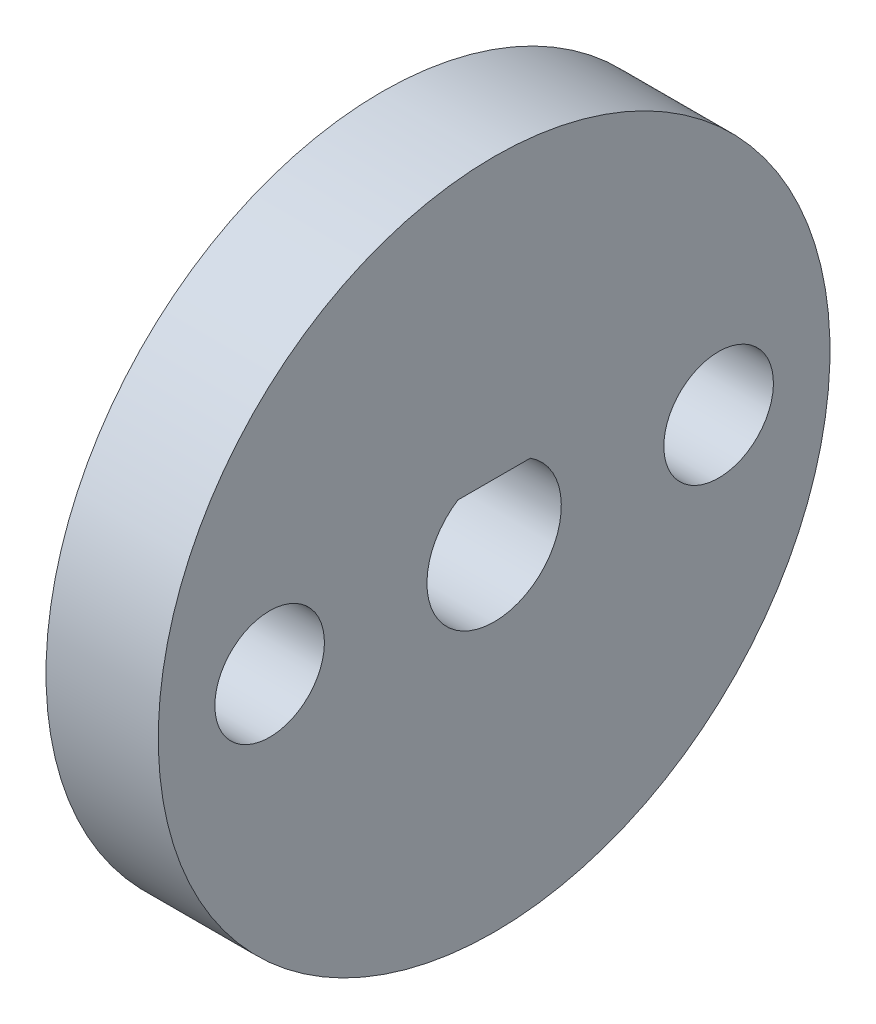
ISO-10303-21;
HEADER;
FILE_DESCRIPTION(('STEP AP214'),'2;1');
FILE_NAME('part.step','',(''),(''),'','','');
FILE_SCHEMA(('AUTOMOTIVE_DESIGN { 1 0 10303 214 1 1 1 1 }'));
ENDSEC;
DATA;
#1=APPLICATION_CONTEXT('core data for automotive mechanical design processes');
#2=APPLICATION_PROTOCOL_DEFINITION('international standard','automotive_design',2000,#1);
#3=PRODUCT_CONTEXT('',#1,'mechanical');
#4=PRODUCT('Part','Part','',(#3));
#5=PRODUCT_RELATED_PRODUCT_CATEGORY('part','',(#4));
#6=PRODUCT_DEFINITION_FORMATION('','',#4);
#7=PRODUCT_DEFINITION_CONTEXT('part definition',#1,'design');
#8=PRODUCT_DEFINITION('design','',#6,#7);
#9=PRODUCT_DEFINITION_SHAPE('','',#8);
#10=(LENGTH_UNIT() NAMED_UNIT(*) SI_UNIT(.MILLI.,.METRE.));
#11=(NAMED_UNIT(*) PLANE_ANGLE_UNIT() SI_UNIT($,.RADIAN.));
#12=(NAMED_UNIT(*) SI_UNIT($,.STERADIAN.) SOLID_ANGLE_UNIT());
#13=UNCERTAINTY_MEASURE_WITH_UNIT(LENGTH_MEASURE(1.E-05),#10,'distance_accuracy_value','');
#14=(GEOMETRIC_REPRESENTATION_CONTEXT(3) GLOBAL_UNCERTAINTY_ASSIGNED_CONTEXT((#13)) GLOBAL_UNIT_ASSIGNED_CONTEXT((#10,
#11,#12)) REPRESENTATION_CONTEXT('',''));
#15=CARTESIAN_POINT('',(0.,0.,0.));
#16=DIRECTION('',(0.,0.,1.));
#17=DIRECTION('',(1.,0.,0.));
#18=AXIS2_PLACEMENT_3D('',#15,#16,#17);
#19=CARTESIAN_POINT('',(5.425,0.,0.));
#20=DIRECTION('',(1.,0.,0.));
#21=DIRECTION('',(0.,1.,0.));
#22=AXIS2_PLACEMENT_3D('',#19,#20,#21);
#23=PLANE('',#22);
#24=CARTESIAN_POINT('',(5.425,0.,6.35));
#25=DIRECTION('',(1.,0.,0.));
#26=DIRECTION('',(0.,1.,0.));
#27=AXIS2_PLACEMENT_3D('',#24,#25,#26);
#28=CIRCLE('',#27,1.5494);
#29=CARTESIAN_POINT('',(5.425,1.54939999999996,6.35));
#30=VERTEX_POINT('',#29);
#31=EDGE_CURVE('E87',#30,#30,#28,.T.);
#32=ORIENTED_EDGE('',*,*,#31,.F.);
#33=EDGE_LOOP('',(#32));
#34=FACE_BOUND('',#33,.T.);
#35=CARTESIAN_POINT('',(5.425,0.,0.));
#36=DIRECTION('',(1.,0.,0.));
#37=DIRECTION('',(0.,1.,0.));
#38=AXIS2_PLACEMENT_3D('',#35,#36,#37);
#39=CIRCLE('',#38,9.5);
#40=CARTESIAN_POINT('',(5.425,9.5,0.));
#41=VERTEX_POINT('',#40);
#42=EDGE_CURVE('E11',#41,#41,#39,.T.);
#43=ORIENTED_EDGE('',*,*,#42,.T.);
#44=EDGE_LOOP('',(#43));
#45=FACE_BOUND('',#44,.T.);
#46=CARTESIAN_POINT('',(5.425,0.,-6.35));
#47=DIRECTION('',(1.,0.,0.));
#48=DIRECTION('',(0.,1.,0.));
#49=AXIS2_PLACEMENT_3D('',#46,#47,#48);
#50=CIRCLE('',#49,1.5494);
#51=CARTESIAN_POINT('',(5.425,1.54940000000005,-6.35));
#52=VERTEX_POINT('',#51);
#53=EDGE_CURVE('E81',#52,#52,#50,.T.);
#54=ORIENTED_EDGE('',*,*,#53,.F.);
#55=EDGE_LOOP('',(#54));
#56=FACE_BOUND('',#55,.T.);
#57=DIRECTION('',(0.,0.,1.));
#58=VECTOR('',#57,1.);
#59=CARTESIAN_POINT('',(5.425,1.6,1.02469507659596));
#60=LINE('',#59,#58);
#61=CARTESIAN_POINT('',(5.425,1.6,-1.02469507659596));
#62=VERTEX_POINT('',#61);
#63=CARTESIAN_POINT('',(5.425,1.6,1.02469507659596));
#64=VERTEX_POINT('',#63);
#65=EDGE_CURVE('E77',#62,#64,#60,.T.);
#66=ORIENTED_EDGE('',*,*,#65,.F.);
#67=CARTESIAN_POINT('',(5.425,0.,0.));
#68=DIRECTION('',(1.,0.,0.));
#69=DIRECTION('',(0.,1.,0.));
#70=AXIS2_PLACEMENT_3D('',#67,#68,#69);
#71=CIRCLE('',#70,1.9);
#72=EDGE_CURVE('E67',#64,#62,#71,.T.);
#73=ORIENTED_EDGE('',*,*,#72,.F.);
#74=EDGE_LOOP('',(#66,#73));
#75=FACE_BOUND('',#74,.T.);
#76=ADVANCED_FACE('F35',(#34,#45,#56,#75),#23,.T.);
#77=CARTESIAN_POINT('',(2.25,0.,0.));
#78=DIRECTION('',(1.,0.,0.));
#79=DIRECTION('',(0.,1.,0.));
#80=AXIS2_PLACEMENT_3D('',#77,#78,#79);
#81=PLANE('',#80);
#82=CARTESIAN_POINT('',(2.25,0.,-6.35));
#83=DIRECTION('',(1.,0.,0.));
#84=DIRECTION('',(0.,1.,0.));
#85=AXIS2_PLACEMENT_3D('',#82,#83,#84);
#86=CIRCLE('',#85,1.5494);
#87=CARTESIAN_POINT('',(2.25,1.54940000000005,-6.35));
#88=VERTEX_POINT('',#87);
#89=EDGE_CURVE('E72',#88,#88,#86,.T.);
#90=ORIENTED_EDGE('',*,*,#89,.T.);
#91=EDGE_LOOP('',(#90));
#92=FACE_BOUND('',#91,.T.);
#93=CARTESIAN_POINT('',(2.25,0.,6.35));
#94=DIRECTION('',(1.,0.,0.));
#95=DIRECTION('',(0.,1.,0.));
#96=AXIS2_PLACEMENT_3D('',#93,#94,#95);
#97=CIRCLE('',#96,1.5494);
#98=CARTESIAN_POINT('',(2.25,1.54939999999996,6.35));
#99=VERTEX_POINT('',#98);
#100=EDGE_CURVE('E84',#99,#99,#97,.T.);
#101=ORIENTED_EDGE('',*,*,#100,.T.);
#102=EDGE_LOOP('',(#101));
#103=FACE_BOUND('',#102,.T.);
#104=CARTESIAN_POINT('',(2.25,0.,0.));
#105=DIRECTION('',(1.,0.,0.));
#106=DIRECTION('',(0.,1.,0.));
#107=AXIS2_PLACEMENT_3D('',#104,#105,#106);
#108=CIRCLE('',#107,9.5);
#109=CARTESIAN_POINT('',(2.25,9.5,0.));
#110=VERTEX_POINT('',#109);
#111=EDGE_CURVE('E39',#110,#110,#108,.T.);
#112=ORIENTED_EDGE('',*,*,#111,.F.);
#113=EDGE_LOOP('',(#112));
#114=FACE_BOUND('',#113,.T.);
#115=CARTESIAN_POINT('',(2.25,0.,0.));
#116=DIRECTION('',(1.,0.,0.));
#117=DIRECTION('',(0.,1.,0.));
#118=AXIS2_PLACEMENT_3D('',#115,#116,#117);
#119=CIRCLE('',#118,1.9);
#120=CARTESIAN_POINT('',(2.25,1.6,1.02469507659596));
#121=VERTEX_POINT('',#120);
#122=CARTESIAN_POINT('',(2.25,1.6,-1.02469507659596));
#123=VERTEX_POINT('',#122);
#124=EDGE_CURVE('E57',#121,#123,#119,.T.);
#125=ORIENTED_EDGE('',*,*,#124,.T.);
#126=DIRECTION('',(0.,0.,1.));
#127=VECTOR('',#126,1.);
#128=CARTESIAN_POINT('',(2.25,1.6,1.02469507659596));
#129=LINE('',#128,#127);
#130=EDGE_CURVE('E63',#123,#121,#129,.T.);
#131=ORIENTED_EDGE('',*,*,#130,.T.);
#132=EDGE_LOOP('',(#125,#131));
#133=FACE_BOUND('',#132,.T.);
#134=ADVANCED_FACE('F74',(#92,#103,#114,#133),#81,.F.);
#135=CARTESIAN_POINT('',(5.425,0.,0.));
#136=DIRECTION('',(-1.,0.,0.));
#137=DIRECTION('',(0.,-1.,0.));
#138=AXIS2_PLACEMENT_3D('',#135,#136,#137);
#139=CYLINDRICAL_SURFACE('',#138,9.5);
#140=ORIENTED_EDGE('',*,*,#42,.F.);
#141=EDGE_LOOP('',(#140));
#142=FACE_BOUND('',#141,.T.);
#143=ORIENTED_EDGE('',*,*,#111,.T.);
#144=EDGE_LOOP('',(#143));
#145=FACE_BOUND('',#144,.T.);
#146=ADVANCED_FACE('F37',(#142,#145),#139,.T.);
#147=CARTESIAN_POINT('',(5.425,0.,6.35));
#148=DIRECTION('',(-1.,0.,0.));
#149=DIRECTION('',(0.,-1.,0.));
#150=AXIS2_PLACEMENT_3D('',#147,#148,#149);
#151=CYLINDRICAL_SURFACE('',#150,1.5494);
#152=ORIENTED_EDGE('',*,*,#31,.T.);
#153=EDGE_LOOP('',(#152));
#154=FACE_BOUND('',#153,.T.);
#155=ORIENTED_EDGE('',*,*,#100,.F.);
#156=EDGE_LOOP('',(#155));
#157=FACE_BOUND('',#156,.T.);
#158=ADVANCED_FACE('F95',(#154,#157),#151,.F.);
#159=CARTESIAN_POINT('',(5.425,0.,-6.35));
#160=DIRECTION('',(-1.,0.,0.));
#161=DIRECTION('',(0.,-1.,0.));
#162=AXIS2_PLACEMENT_3D('',#159,#160,#161);
#163=CYLINDRICAL_SURFACE('',#162,1.5494);
#164=ORIENTED_EDGE('',*,*,#53,.T.);
#165=EDGE_LOOP('',(#164));
#166=FACE_BOUND('',#165,.T.);
#167=ORIENTED_EDGE('',*,*,#89,.F.);
#168=EDGE_LOOP('',(#167));
#169=FACE_BOUND('',#168,.T.);
#170=ADVANCED_FACE('F97',(#166,#169),#163,.F.);
#171=CARTESIAN_POINT('',(5.425,0.,0.));
#172=DIRECTION('',(-1.,0.,0.));
#173=DIRECTION('',(0.,-1.,0.));
#174=AXIS2_PLACEMENT_3D('',#171,#172,#173);
#175=CYLINDRICAL_SURFACE('',#174,1.9);
#176=ORIENTED_EDGE('',*,*,#124,.F.);
#177=DIRECTION('',(-1.,0.,0.));
#178=VECTOR('',#177,1.);
#179=CARTESIAN_POINT('',(5.425,1.6,1.02469507659596));
#180=LINE('',#179,#178);
#181=EDGE_CURVE('E65',#64,#121,#180,.T.);
#182=ORIENTED_EDGE('',*,*,#181,.F.);
#183=ORIENTED_EDGE('',*,*,#72,.T.);
#184=DIRECTION('',(-1.,0.,0.));
#185=VECTOR('',#184,1.);
#186=CARTESIAN_POINT('',(5.425,1.6,-1.02469507659596));
#187=LINE('',#186,#185);
#188=EDGE_CURVE('E50',#62,#123,#187,.T.);
#189=ORIENTED_EDGE('',*,*,#188,.T.);
#190=EDGE_LOOP('',(#176,#182,#183,#189));
#191=FACE_BOUND('',#190,.T.);
#192=ADVANCED_FACE('F69',(#191),#175,.F.);
#193=CARTESIAN_POINT('',(5.425,1.6,1.02469507659596));
#194=DIRECTION('',(0.,-1.,0.));
#195=DIRECTION('',(1.,0.,0.));
#196=AXIS2_PLACEMENT_3D('',#193,#194,#195);
#197=PLANE('',#196);
#198=ORIENTED_EDGE('',*,*,#130,.F.);
#199=ORIENTED_EDGE('',*,*,#188,.F.);
#200=ORIENTED_EDGE('',*,*,#65,.T.);
#201=ORIENTED_EDGE('',*,*,#181,.T.);
#202=EDGE_LOOP('',(#198,#199,#200,#201));
#203=FACE_BOUND('',#202,.T.);
#204=ADVANCED_FACE('F64',(#203),#197,.T.);
#205=CLOSED_SHELL('',(#76,#134,#146,#158,#170,#192,#204));
#206=MANIFOLD_SOLID_BREP('B2',#205);
#207=ADVANCED_BREP_SHAPE_REPRESENTATION('',(#18,#206),#14);
#208=SHAPE_DEFINITION_REPRESENTATION(#9,#207);
ENDSEC;
END-ISO-10303-21;
